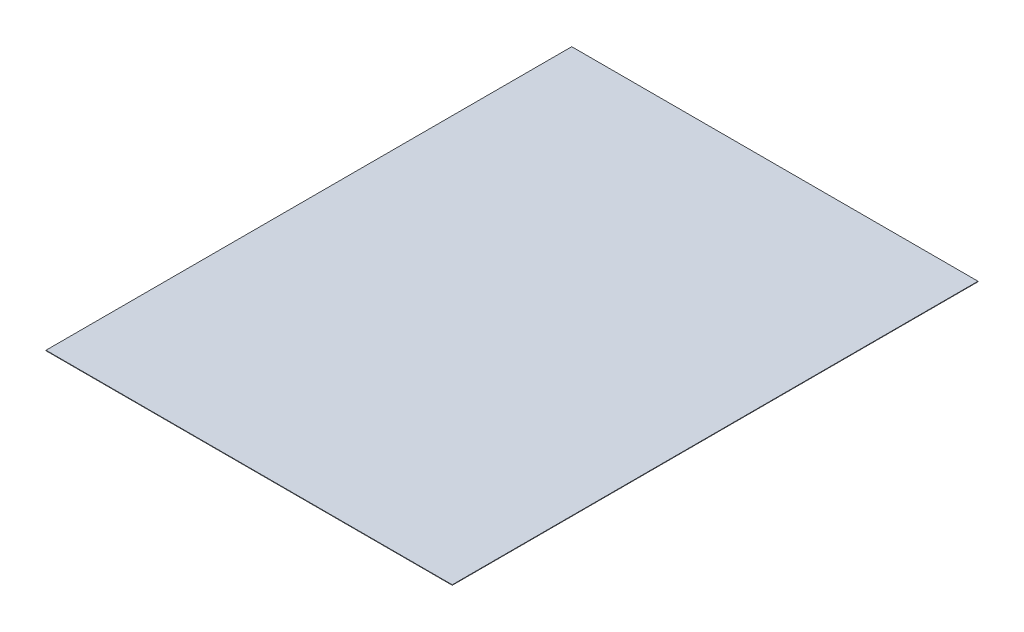
ISO-10303-21;
HEADER;
FILE_DESCRIPTION(('STEP AP214'),'2;1');
FILE_NAME('part.step','',(''),(''),'','','');
FILE_SCHEMA(('AUTOMOTIVE_DESIGN { 1 0 10303 214 1 1 1 1 }'));
ENDSEC;
DATA;
#1=APPLICATION_CONTEXT('core data for automotive mechanical design processes');
#2=APPLICATION_PROTOCOL_DEFINITION('international standard','automotive_design',2000,#1);
#3=PRODUCT_CONTEXT('',#1,'mechanical');
#4=PRODUCT('Part','Part','',(#3));
#5=PRODUCT_RELATED_PRODUCT_CATEGORY('part','',(#4));
#6=PRODUCT_DEFINITION_FORMATION('','',#4);
#7=PRODUCT_DEFINITION_CONTEXT('part definition',#1,'design');
#8=PRODUCT_DEFINITION('design','',#6,#7);
#9=PRODUCT_DEFINITION_SHAPE('','',#8);
#10=(LENGTH_UNIT() NAMED_UNIT(*) SI_UNIT(.MILLI.,.METRE.));
#11=(NAMED_UNIT(*) PLANE_ANGLE_UNIT() SI_UNIT($,.RADIAN.));
#12=(NAMED_UNIT(*) SI_UNIT($,.STERADIAN.) SOLID_ANGLE_UNIT());
#13=UNCERTAINTY_MEASURE_WITH_UNIT(LENGTH_MEASURE(1.E-05),#10,'distance_accuracy_value','');
#14=(GEOMETRIC_REPRESENTATION_CONTEXT(3) GLOBAL_UNCERTAINTY_ASSIGNED_CONTEXT((#13)) GLOBAL_UNIT_ASSIGNED_CONTEXT((#10,
#11,#12)) REPRESENTATION_CONTEXT('',''));
#15=CARTESIAN_POINT('',(0.,0.,0.));
#16=DIRECTION('',(0.,0.,1.));
#17=DIRECTION('',(1.,0.,0.));
#18=AXIS2_PLACEMENT_3D('',#15,#16,#17);
#19=CARTESIAN_POINT('',(0.,0.254,0.));
#20=DIRECTION('',(1.,0.,0.));
#21=DIRECTION('',(0.,0.,-1.));
#22=AXIS2_PLACEMENT_3D('',#19,#20,#21);
#23=PLANE('',#22);
#24=DIRECTION('',(0.,0.,1.));
#25=VECTOR('',#24,1.);
#26=CARTESIAN_POINT('',(0.,0.,0.));
#27=LINE('',#26,#25);
#28=CARTESIAN_POINT('',(0.,0.,-279.4));
#29=VERTEX_POINT('',#28);
#30=CARTESIAN_POINT('',(0.,0.,0.));
#31=VERTEX_POINT('',#30);
#32=EDGE_CURVE('E99',#29,#31,#27,.T.);
#33=ORIENTED_EDGE('',*,*,#32,.T.);
#34=DIRECTION('',(0.,-1.,0.));
#35=VECTOR('',#34,1.);
#36=CARTESIAN_POINT('',(0.,0.254,0.));
#37=LINE('',#36,#35);
#38=CARTESIAN_POINT('',(0.,0.254,0.));
#39=VERTEX_POINT('',#38);
#40=EDGE_CURVE('E11',#39,#31,#37,.T.);
#41=ORIENTED_EDGE('',*,*,#40,.F.);
#42=DIRECTION('',(0.,0.,1.));
#43=VECTOR('',#42,1.);
#44=CARTESIAN_POINT('',(0.,0.254,0.));
#45=LINE('',#44,#43);
#46=CARTESIAN_POINT('',(0.,0.254,-279.4));
#47=VERTEX_POINT('',#46);
#48=EDGE_CURVE('E87',#47,#39,#45,.T.);
#49=ORIENTED_EDGE('',*,*,#48,.F.);
#50=DIRECTION('',(0.,-1.,0.));
#51=VECTOR('',#50,1.);
#52=CARTESIAN_POINT('',(0.,0.254,-279.4));
#53=LINE('',#52,#51);
#54=EDGE_CURVE('E95',#47,#29,#53,.T.);
#55=ORIENTED_EDGE('',*,*,#54,.T.);
#56=EDGE_LOOP('',(#33,#41,#49,#55));
#57=FACE_BOUND('',#56,.T.);
#58=ADVANCED_FACE('F36',(#57),#23,.F.);
#59=CARTESIAN_POINT('',(0.,0.254,0.));
#60=DIRECTION('',(0.,0.,-1.));
#61=DIRECTION('',(-1.,0.,0.));
#62=AXIS2_PLACEMENT_3D('',#59,#60,#61);
#63=PLANE('',#62);
#64=DIRECTION('',(1.,0.,0.));
#65=VECTOR('',#64,1.);
#66=CARTESIAN_POINT('',(0.,0.,0.));
#67=LINE('',#66,#65);
#68=CARTESIAN_POINT('',(215.9,0.,0.));
#69=VERTEX_POINT('',#68);
#70=EDGE_CURVE('E91',#31,#69,#67,.T.);
#71=ORIENTED_EDGE('',*,*,#70,.T.);
#72=DIRECTION('',(0.,-1.,0.));
#73=VECTOR('',#72,1.);
#74=CARTESIAN_POINT('',(215.9,0.254,0.));
#75=LINE('',#74,#73);
#76=CARTESIAN_POINT('',(215.9,0.254,0.));
#77=VERTEX_POINT('',#76);
#78=EDGE_CURVE('E44',#77,#69,#75,.T.);
#79=ORIENTED_EDGE('',*,*,#78,.F.);
#80=DIRECTION('',(1.,0.,0.));
#81=VECTOR('',#80,1.);
#82=CARTESIAN_POINT('',(0.,0.254,0.));
#83=LINE('',#82,#81);
#84=EDGE_CURVE('E82',#39,#77,#83,.T.);
#85=ORIENTED_EDGE('',*,*,#84,.F.);
#86=ORIENTED_EDGE('',*,*,#40,.T.);
#87=EDGE_LOOP('',(#71,#79,#85,#86));
#88=FACE_BOUND('',#87,.T.);
#89=ADVANCED_FACE('F90',(#88),#63,.F.);
#90=CARTESIAN_POINT('',(215.9,0.254,0.));
#91=DIRECTION('',(-1.,0.,0.));
#92=DIRECTION('',(0.,0.,1.));
#93=AXIS2_PLACEMENT_3D('',#90,#91,#92);
#94=PLANE('',#93);
#95=DIRECTION('',(0.,0.,-1.));
#96=VECTOR('',#95,1.);
#97=CARTESIAN_POINT('',(215.9,0.,0.));
#98=LINE('',#97,#96);
#99=CARTESIAN_POINT('',(215.9,0.,-279.4));
#100=VERTEX_POINT('',#99);
#101=EDGE_CURVE('E69',#69,#100,#98,.T.);
#102=ORIENTED_EDGE('',*,*,#101,.T.);
#103=DIRECTION('',(0.,-1.,0.));
#104=VECTOR('',#103,1.);
#105=CARTESIAN_POINT('',(215.9,0.254,-279.4));
#106=LINE('',#105,#104);
#107=CARTESIAN_POINT('',(215.9,0.254,-279.4));
#108=VERTEX_POINT('',#107);
#109=EDGE_CURVE('E92',#108,#100,#106,.T.);
#110=ORIENTED_EDGE('',*,*,#109,.F.);
#111=DIRECTION('',(0.,0.,-1.));
#112=VECTOR('',#111,1.);
#113=CARTESIAN_POINT('',(215.9,0.254,0.));
#114=LINE('',#113,#112);
#115=EDGE_CURVE('E85',#77,#108,#114,.T.);
#116=ORIENTED_EDGE('',*,*,#115,.F.);
#117=ORIENTED_EDGE('',*,*,#78,.T.);
#118=EDGE_LOOP('',(#102,#110,#116,#117));
#119=FACE_BOUND('',#118,.T.);
#120=ADVANCED_FACE('F93',(#119),#94,.F.);
#121=CARTESIAN_POINT('',(0.,0.254,-279.4));
#122=DIRECTION('',(0.,0.,1.));
#123=DIRECTION('',(1.,0.,0.));
#124=AXIS2_PLACEMENT_3D('',#121,#122,#123);
#125=PLANE('',#124);
#126=DIRECTION('',(-1.,0.,0.));
#127=VECTOR('',#126,1.);
#128=CARTESIAN_POINT('',(0.,0.,-279.4));
#129=LINE('',#128,#127);
#130=EDGE_CURVE('E75',#100,#29,#129,.T.);
#131=ORIENTED_EDGE('',*,*,#130,.T.);
#132=ORIENTED_EDGE('',*,*,#54,.F.);
#133=DIRECTION('',(-1.,0.,0.));
#134=VECTOR('',#133,1.);
#135=CARTESIAN_POINT('',(0.,0.254,-279.4));
#136=LINE('',#135,#134);
#137=EDGE_CURVE('E52',#108,#47,#136,.T.);
#138=ORIENTED_EDGE('',*,*,#137,.F.);
#139=ORIENTED_EDGE('',*,*,#109,.T.);
#140=EDGE_LOOP('',(#131,#132,#138,#139));
#141=FACE_BOUND('',#140,.T.);
#142=ADVANCED_FACE('F106',(#141),#125,.F.);
#143=CARTESIAN_POINT('',(0.,0.254,0.));
#144=DIRECTION('',(0.,-1.,0.));
#145=DIRECTION('',(0.,0.,-1.));
#146=AXIS2_PLACEMENT_3D('',#143,#144,#145);
#147=PLANE('',#146);
#148=ORIENTED_EDGE('',*,*,#48,.T.);
#149=ORIENTED_EDGE('',*,*,#84,.T.);
#150=ORIENTED_EDGE('',*,*,#115,.T.);
#151=ORIENTED_EDGE('',*,*,#137,.T.);
#152=EDGE_LOOP('',(#148,#149,#150,#151));
#153=FACE_BOUND('',#152,.T.);
#154=ADVANCED_FACE('F83',(#153),#147,.F.);
#155=CARTESIAN_POINT('',(0.,0.,0.));
#156=DIRECTION('',(0.,-1.,0.));
#157=DIRECTION('',(0.,0.,-1.));
#158=AXIS2_PLACEMENT_3D('',#155,#156,#157);
#159=PLANE('',#158);
#160=ORIENTED_EDGE('',*,*,#32,.F.);
#161=ORIENTED_EDGE('',*,*,#130,.F.);
#162=ORIENTED_EDGE('',*,*,#101,.F.);
#163=ORIENTED_EDGE('',*,*,#70,.F.);
#164=EDGE_LOOP('',(#160,#161,#162,#163));
#165=FACE_BOUND('',#164,.T.);
#166=ADVANCED_FACE('F109',(#165),#159,.T.);
#167=CLOSED_SHELL('',(#58,#89,#120,#142,#154,#166));
#168=MANIFOLD_SOLID_BREP('B2',#167);
#169=ADVANCED_BREP_SHAPE_REPRESENTATION('',(#18,#168),#14);
#170=SHAPE_DEFINITION_REPRESENTATION(#9,#169);
ENDSEC;
END-ISO-10303-21;
